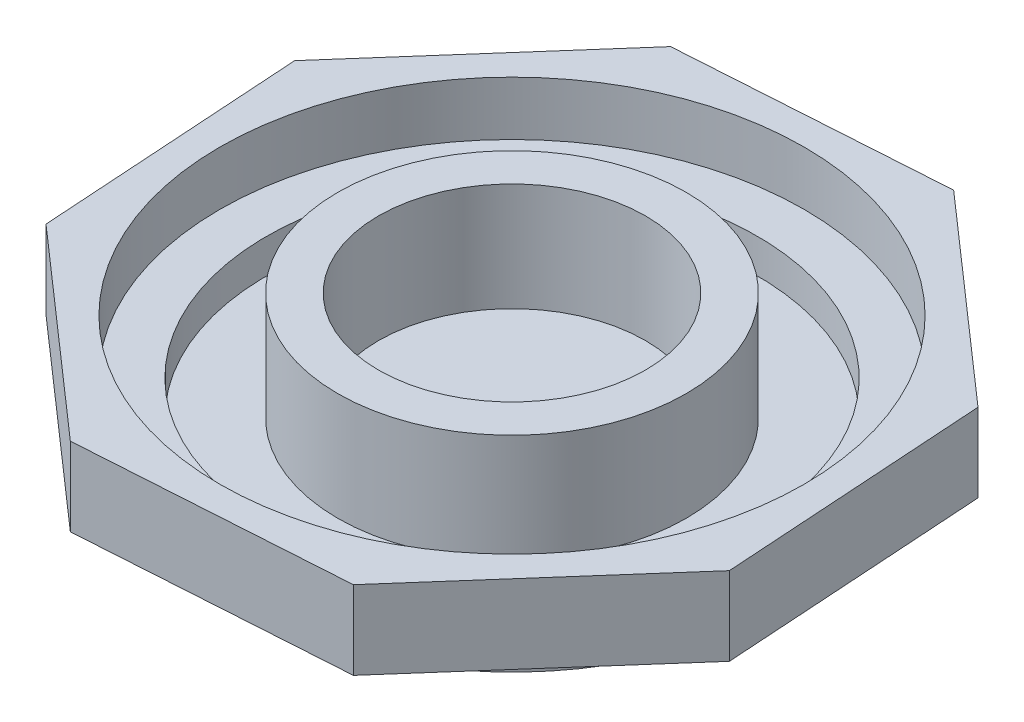
ISO-10303-21;
HEADER;
FILE_DESCRIPTION(('STEP AP214'),'2;1');
FILE_NAME('part.step','',(''),(''),'','','');
FILE_SCHEMA(('AUTOMOTIVE_DESIGN { 1 0 10303 214 1 1 1 1 }'));
ENDSEC;
DATA;
#1=APPLICATION_CONTEXT('core data for automotive mechanical design processes');
#2=APPLICATION_PROTOCOL_DEFINITION('international standard','automotive_design',2000,#1);
#3=PRODUCT_CONTEXT('',#1,'mechanical');
#4=PRODUCT('Part','Part','',(#3));
#5=PRODUCT_RELATED_PRODUCT_CATEGORY('part','',(#4));
#6=PRODUCT_DEFINITION_FORMATION('','',#4);
#7=PRODUCT_DEFINITION_CONTEXT('part definition',#1,'design');
#8=PRODUCT_DEFINITION('design','',#6,#7);
#9=PRODUCT_DEFINITION_SHAPE('','',#8);
#10=(LENGTH_UNIT() NAMED_UNIT(*) SI_UNIT(.MILLI.,.METRE.));
#11=(NAMED_UNIT(*) PLANE_ANGLE_UNIT() SI_UNIT($,.RADIAN.));
#12=(NAMED_UNIT(*) SI_UNIT($,.STERADIAN.) SOLID_ANGLE_UNIT());
#13=UNCERTAINTY_MEASURE_WITH_UNIT(LENGTH_MEASURE(1.E-05),#10,'distance_accuracy_value','');
#14=(GEOMETRIC_REPRESENTATION_CONTEXT(3) GLOBAL_UNCERTAINTY_ASSIGNED_CONTEXT((#13)) GLOBAL_UNIT_ASSIGNED_CONTEXT((#10,
#11,#12)) REPRESENTATION_CONTEXT('',''));
#15=CARTESIAN_POINT('',(0.,0.,0.));
#16=DIRECTION('',(0.,0.,1.));
#17=DIRECTION('',(1.,0.,0.));
#18=AXIS2_PLACEMENT_3D('',#15,#16,#17);
#19=CARTESIAN_POINT('',(0.,2.,0.));
#20=DIRECTION('',(0.,-1.,0.));
#21=DIRECTION('',(0.,0.,-1.));
#22=AXIS2_PLACEMENT_3D('',#19,#20,#21);
#23=CYLINDRICAL_SURFACE('',#22,13.75);
#24=CARTESIAN_POINT('',(0.,2.,0.));
#25=DIRECTION('',(0.,1.,0.));
#26=DIRECTION('',(0.,0.,1.));
#27=AXIS2_PLACEMENT_3D('',#24,#25,#26);
#28=CIRCLE('',#27,13.75);
#29=CARTESIAN_POINT('',(0.,2.,13.75));
#30=VERTEX_POINT('',#29);
#31=EDGE_CURVE('E11',#30,#30,#28,.T.);
#32=ORIENTED_EDGE('',*,*,#31,.F.);
#33=EDGE_LOOP('',(#32));
#34=FACE_BOUND('',#33,.T.);
#35=CARTESIAN_POINT('',(0.,0.,0.));
#36=DIRECTION('',(0.,1.,0.));
#37=DIRECTION('',(0.,0.,1.));
#38=AXIS2_PLACEMENT_3D('',#35,#36,#37);
#39=CIRCLE('',#38,13.75);
#40=CARTESIAN_POINT('',(0.,0.,13.75));
#41=VERTEX_POINT('',#40);
#42=EDGE_CURVE('E36',#41,#41,#39,.T.);
#43=ORIENTED_EDGE('',*,*,#42,.T.);
#44=EDGE_LOOP('',(#43));
#45=FACE_BOUND('',#44,.T.);
#46=ADVANCED_FACE('F33',(#34,#45),#23,.T.);
#47=CARTESIAN_POINT('',(0.,0.,0.));
#48=DIRECTION('',(0.,1.,0.));
#49=DIRECTION('',(0.,0.,1.));
#50=AXIS2_PLACEMENT_3D('',#47,#48,#49);
#51=PLANE('',#50);
#52=ORIENTED_EDGE('',*,*,#42,.F.);
#53=EDGE_LOOP('',(#52));
#54=FACE_BOUND('',#53,.T.);
#55=ADVANCED_FACE('F164',(#54),#51,.F.);
#56=CARTESIAN_POINT('',(7.82639063037997,6.,15.9026379165315));
#57=DIRECTION('',(-0.751308324484586,0.,-0.659951363026219));
#58=DIRECTION('',(-0.659951363026219,0.,0.751308324484586));
#59=AXIS2_PLACEMENT_3D('',#56,#57,#58);
#60=PLANE('',#59);
#61=DIRECTION('',(0.659951363026219,0.,-0.751308324484586));
#62=VECTOR('',#61,1.);
#63=CARTESIAN_POINT('',(7.82639063037997,2.,15.9026379165315));
#64=LINE('',#63,#62);
#65=CARTESIAN_POINT('',(7.82639063037997,2.,15.9026379165315));
#66=VERTEX_POINT('',#65);
#67=CARTESIAN_POINT('',(16.7789569964903,2.,5.7107692225772));
#68=VERTEX_POINT('',#67);
#69=EDGE_CURVE('E130',#66,#68,#64,.T.);
#70=ORIENTED_EDGE('',*,*,#69,.T.);
#71=DIRECTION('',(0.,-1.,0.));
#72=VECTOR('',#71,1.);
#73=CARTESIAN_POINT('',(16.7789569964903,6.,5.7107692225772));
#74=LINE('',#73,#72);
#75=CARTESIAN_POINT('',(16.7789569964903,6.,5.7107692225772));
#76=VERTEX_POINT('',#75);
#77=EDGE_CURVE('E158',#76,#68,#74,.T.);
#78=ORIENTED_EDGE('',*,*,#77,.F.);
#79=DIRECTION('',(0.659951363026219,0.,-0.751308324484586));
#80=VECTOR('',#79,1.);
#81=CARTESIAN_POINT('',(7.82639063037997,6.,15.9026379165315));
#82=LINE('',#81,#80);
#83=CARTESIAN_POINT('',(7.82639063037997,6.,15.9026379165315));
#84=VERTEX_POINT('',#83);
#85=EDGE_CURVE('E145',#84,#76,#82,.T.);
#86=ORIENTED_EDGE('',*,*,#85,.F.);
#87=DIRECTION('',(0.,-1.,0.));
#88=VECTOR('',#87,1.);
#89=CARTESIAN_POINT('',(7.82639063037997,6.,15.9026379165315));
#90=LINE('',#89,#88);
#91=EDGE_CURVE('E126',#84,#66,#90,.T.);
#92=ORIENTED_EDGE('',*,*,#91,.T.);
#93=EDGE_LOOP('',(#70,#78,#86,#92));
#94=FACE_BOUND('',#93,.T.);
#95=ADVANCED_FACE('F166',(#94),#60,.F.);
#96=CARTESIAN_POINT('',(16.7789569964903,6.,5.7107692225772));
#97=DIRECTION('',(-0.997911295054098,0.,0.0645991269558095));
#98=DIRECTION('',(0.0645991269558095,0.,0.997911295054098));
#99=AXIS2_PLACEMENT_3D('',#96,#97,#98);
#100=PLANE('',#99);
#101=DIRECTION('',(-0.0645991269558095,0.,-0.997911295054098));
#102=VECTOR('',#101,1.);
#103=CARTESIAN_POINT('',(16.7789569964903,2.,5.7107692225772));
#104=LINE('',#103,#102);
#105=CARTESIAN_POINT('',(15.9026379165315,2.,-7.82639063037997));
#106=VERTEX_POINT('',#105);
#107=EDGE_CURVE('E133',#68,#106,#104,.T.);
#108=ORIENTED_EDGE('',*,*,#107,.T.);
#109=DIRECTION('',(0.,-1.,0.));
#110=VECTOR('',#109,1.);
#111=CARTESIAN_POINT('',(15.9026379165315,6.,-7.82639063037997));
#112=LINE('',#111,#110);
#113=CARTESIAN_POINT('',(15.9026379165315,6.,-7.82639063037997));
#114=VERTEX_POINT('',#113);
#115=EDGE_CURVE('E155',#114,#106,#112,.T.);
#116=ORIENTED_EDGE('',*,*,#115,.F.);
#117=DIRECTION('',(-0.0645991269558095,0.,-0.997911295054098));
#118=VECTOR('',#117,1.);
#119=CARTESIAN_POINT('',(16.7789569964903,6.,5.7107692225772));
#120=LINE('',#119,#118);
#121=EDGE_CURVE('E93',#76,#114,#120,.T.);
#122=ORIENTED_EDGE('',*,*,#121,.F.);
#123=ORIENTED_EDGE('',*,*,#77,.T.);
#124=EDGE_LOOP('',(#108,#116,#122,#123));
#125=FACE_BOUND('',#124,.T.);
#126=ADVANCED_FACE('F171',(#125),#100,.F.);
#127=CARTESIAN_POINT('',(15.9026379165315,6.,-7.82639063037997));
#128=DIRECTION('',(-0.659951363026218,0.,0.751308324484586));
#129=DIRECTION('',(0.751308324484586,0.,0.659951363026218));
#130=AXIS2_PLACEMENT_3D('',#127,#128,#129);
#131=PLANE('',#130);
#132=DIRECTION('',(-0.751308324484586,0.,-0.659951363026218));
#133=VECTOR('',#132,1.);
#134=CARTESIAN_POINT('',(15.9026379165315,2.,-7.82639063037997));
#135=LINE('',#134,#133);
#136=CARTESIAN_POINT('',(5.71076922257719,2.,-16.7789569964903));
#137=VERTEX_POINT('',#136);
#138=EDGE_CURVE('E136',#106,#137,#135,.T.);
#139=ORIENTED_EDGE('',*,*,#138,.T.);
#140=DIRECTION('',(0.,-1.,0.));
#141=VECTOR('',#140,1.);
#142=CARTESIAN_POINT('',(5.71076922257719,6.,-16.7789569964903));
#143=LINE('',#142,#141);
#144=CARTESIAN_POINT('',(5.71076922257719,6.,-16.7789569964903));
#145=VERTEX_POINT('',#144);
#146=EDGE_CURVE('E152',#145,#137,#143,.T.);
#147=ORIENTED_EDGE('',*,*,#146,.F.);
#148=DIRECTION('',(-0.751308324484586,0.,-0.659951363026218));
#149=VECTOR('',#148,1.);
#150=CARTESIAN_POINT('',(15.9026379165315,6.,-7.82639063037997));
#151=LINE('',#150,#149);
#152=EDGE_CURVE('E264',#114,#145,#151,.T.);
#153=ORIENTED_EDGE('',*,*,#152,.F.);
#154=ORIENTED_EDGE('',*,*,#115,.T.);
#155=EDGE_LOOP('',(#139,#147,#153,#154));
#156=FACE_BOUND('',#155,.T.);
#157=ADVANCED_FACE('F178',(#156),#131,.F.);
#158=CARTESIAN_POINT('',(5.71076922257719,6.,-16.7789569964903));
#159=DIRECTION('',(0.0645991269558098,0.,0.997911295054098));
#160=DIRECTION('',(0.997911295054098,0.,-0.0645991269558098));
#161=AXIS2_PLACEMENT_3D('',#158,#159,#160);
#162=PLANE('',#161);
#163=DIRECTION('',(-0.997911295054098,0.,0.0645991269558098));
#164=VECTOR('',#163,1.);
#165=CARTESIAN_POINT('',(5.71076922257719,2.,-16.7789569964903));
#166=LINE('',#165,#164);
#167=CARTESIAN_POINT('',(-7.82639063037997,2.,-15.9026379165315));
#168=VERTEX_POINT('',#167);
#169=EDGE_CURVE('E138',#137,#168,#166,.T.);
#170=ORIENTED_EDGE('',*,*,#169,.T.);
#171=DIRECTION('',(0.,-1.,0.));
#172=VECTOR('',#171,1.);
#173=CARTESIAN_POINT('',(-7.82639063037997,6.,-15.9026379165315));
#174=LINE('',#173,#172);
#175=CARTESIAN_POINT('',(-7.82639063037997,6.,-15.9026379165315));
#176=VERTEX_POINT('',#175);
#177=EDGE_CURVE('E149',#176,#168,#174,.T.);
#178=ORIENTED_EDGE('',*,*,#177,.F.);
#179=DIRECTION('',(-0.997911295054098,0.,0.0645991269558098));
#180=VECTOR('',#179,1.);
#181=CARTESIAN_POINT('',(5.71076922257719,6.,-16.7789569964903));
#182=LINE('',#181,#180);
#183=EDGE_CURVE('E266',#145,#176,#182,.T.);
#184=ORIENTED_EDGE('',*,*,#183,.F.);
#185=ORIENTED_EDGE('',*,*,#146,.T.);
#186=EDGE_LOOP('',(#170,#178,#184,#185));
#187=FACE_BOUND('',#186,.T.);
#188=ADVANCED_FACE('F181',(#187),#162,.F.);
#189=CARTESIAN_POINT('',(-7.82639063037997,6.,-15.9026379165315));
#190=DIRECTION('',(0.751308324484586,0.,0.659951363026218));
#191=DIRECTION('',(0.659951363026218,0.,-0.751308324484586));
#192=AXIS2_PLACEMENT_3D('',#189,#190,#191);
#193=PLANE('',#192);
#194=DIRECTION('',(-0.659951363026218,0.,0.751308324484586));
#195=VECTOR('',#194,1.);
#196=CARTESIAN_POINT('',(-7.82639063037997,2.,-15.9026379165315));
#197=LINE('',#196,#195);
#198=CARTESIAN_POINT('',(-16.7789569964903,2.,-5.7107692225772));
#199=VERTEX_POINT('',#198);
#200=EDGE_CURVE('E140',#168,#199,#197,.T.);
#201=ORIENTED_EDGE('',*,*,#200,.T.);
#202=DIRECTION('',(0.,-1.,0.));
#203=VECTOR('',#202,1.);
#204=CARTESIAN_POINT('',(-16.7789569964903,6.,-5.7107692225772));
#205=LINE('',#204,#203);
#206=CARTESIAN_POINT('',(-16.7789569964903,6.,-5.7107692225772));
#207=VERTEX_POINT('',#206);
#208=EDGE_CURVE('E121',#207,#199,#205,.T.);
#209=ORIENTED_EDGE('',*,*,#208,.F.);
#210=DIRECTION('',(-0.659951363026218,0.,0.751308324484586));
#211=VECTOR('',#210,1.);
#212=CARTESIAN_POINT('',(-7.82639063037997,6.,-15.9026379165315));
#213=LINE('',#212,#211);
#214=EDGE_CURVE('E112',#176,#207,#213,.T.);
#215=ORIENTED_EDGE('',*,*,#214,.F.);
#216=ORIENTED_EDGE('',*,*,#177,.T.);
#217=EDGE_LOOP('',(#201,#209,#215,#216));
#218=FACE_BOUND('',#217,.T.);
#219=ADVANCED_FACE('F185',(#218),#193,.F.);
#220=CARTESIAN_POINT('',(-16.7789569964903,6.,-5.7107692225772));
#221=DIRECTION('',(0.997911295054098,0.,-0.0645991269558095));
#222=DIRECTION('',(-0.0645991269558095,0.,-0.997911295054098));
#223=AXIS2_PLACEMENT_3D('',#220,#221,#222);
#224=PLANE('',#223);
#225=DIRECTION('',(0.0645991269558095,0.,0.997911295054098));
#226=VECTOR('',#225,1.);
#227=CARTESIAN_POINT('',(-16.7789569964903,2.,-5.7107692225772));
#228=LINE('',#227,#226);
#229=CARTESIAN_POINT('',(-15.9026379165315,2.,7.82639063037997));
#230=VERTEX_POINT('',#229);
#231=EDGE_CURVE('E120',#199,#230,#228,.T.);
#232=ORIENTED_EDGE('',*,*,#231,.T.);
#233=DIRECTION('',(0.,-1.,0.));
#234=VECTOR('',#233,1.);
#235=CARTESIAN_POINT('',(-15.9026379165315,6.,7.82639063037997));
#236=LINE('',#235,#234);
#237=CARTESIAN_POINT('',(-15.9026379165315,6.,7.82639063037997));
#238=VERTEX_POINT('',#237);
#239=EDGE_CURVE('E117',#238,#230,#236,.T.);
#240=ORIENTED_EDGE('',*,*,#239,.F.);
#241=DIRECTION('',(0.0645991269558095,0.,0.997911295054098));
#242=VECTOR('',#241,1.);
#243=CARTESIAN_POINT('',(-16.7789569964903,6.,-5.7107692225772));
#244=LINE('',#243,#242);
#245=EDGE_CURVE('E106',#207,#238,#244,.T.);
#246=ORIENTED_EDGE('',*,*,#245,.F.);
#247=ORIENTED_EDGE('',*,*,#208,.T.);
#248=EDGE_LOOP('',(#232,#240,#246,#247));
#249=FACE_BOUND('',#248,.T.);
#250=ADVANCED_FACE('F118',(#249),#224,.F.);
#251=CARTESIAN_POINT('',(-15.9026379165315,6.,7.82639063037997));
#252=DIRECTION('',(0.659951363026219,0.,-0.751308324484586));
#253=DIRECTION('',(-0.751308324484586,0.,-0.659951363026219));
#254=AXIS2_PLACEMENT_3D('',#251,#252,#253);
#255=PLANE('',#254);
#256=DIRECTION('',(0.751308324484586,0.,0.659951363026219));
#257=VECTOR('',#256,1.);
#258=CARTESIAN_POINT('',(-15.9026379165315,2.,7.82639063037997));
#259=LINE('',#258,#257);
#260=CARTESIAN_POINT('',(-5.71076922257721,2.,16.7789569964903));
#261=VERTEX_POINT('',#260);
#262=EDGE_CURVE('E78',#230,#261,#259,.T.);
#263=ORIENTED_EDGE('',*,*,#262,.T.);
#264=DIRECTION('',(0.,-1.,0.));
#265=VECTOR('',#264,1.);
#266=CARTESIAN_POINT('',(-5.71076922257721,6.,16.7789569964903));
#267=LINE('',#266,#265);
#268=CARTESIAN_POINT('',(-5.71076922257721,6.,16.7789569964903));
#269=VERTEX_POINT('',#268);
#270=EDGE_CURVE('E122',#269,#261,#267,.T.);
#271=ORIENTED_EDGE('',*,*,#270,.F.);
#272=DIRECTION('',(0.751308324484586,0.,0.659951363026219));
#273=VECTOR('',#272,1.);
#274=CARTESIAN_POINT('',(-15.9026379165315,6.,7.82639063037997));
#275=LINE('',#274,#273);
#276=EDGE_CURVE('E110',#238,#269,#275,.T.);
#277=ORIENTED_EDGE('',*,*,#276,.F.);
#278=ORIENTED_EDGE('',*,*,#239,.T.);
#279=EDGE_LOOP('',(#263,#271,#277,#278));
#280=FACE_BOUND('',#279,.T.);
#281=ADVANCED_FACE('F124',(#280),#255,.F.);
#282=CARTESIAN_POINT('',(-5.71076922257721,6.,16.7789569964903));
#283=DIRECTION('',(-0.0645991269558097,0.,-0.997911295054098));
#284=DIRECTION('',(-0.997911295054098,0.,0.0645991269558097));
#285=AXIS2_PLACEMENT_3D('',#282,#283,#284);
#286=PLANE('',#285);
#287=DIRECTION('',(0.997911295054098,0.,-0.0645991269558097));
#288=VECTOR('',#287,1.);
#289=CARTESIAN_POINT('',(-5.71076922257721,2.,16.7789569964903));
#290=LINE('',#289,#288);
#291=EDGE_CURVE('E84',#261,#66,#290,.T.);
#292=ORIENTED_EDGE('',*,*,#291,.T.);
#293=ORIENTED_EDGE('',*,*,#91,.F.);
#294=DIRECTION('',(0.997911295054098,0.,-0.0645991269558097));
#295=VECTOR('',#294,1.);
#296=CARTESIAN_POINT('',(-5.71076922257721,6.,16.7789569964903));
#297=LINE('',#296,#295);
#298=EDGE_CURVE('E49',#269,#84,#297,.T.);
#299=ORIENTED_EDGE('',*,*,#298,.F.);
#300=ORIENTED_EDGE('',*,*,#270,.T.);
#301=EDGE_LOOP('',(#292,#293,#299,#300));
#302=FACE_BOUND('',#301,.T.);
#303=ADVANCED_FACE('F194',(#302),#286,.F.);
#304=CARTESIAN_POINT('',(0.,6.,0.));
#305=DIRECTION('',(0.,1.,0.));
#306=DIRECTION('',(0.,0.,1.));
#307=AXIS2_PLACEMENT_3D('',#304,#305,#306);
#308=PLANE('',#307);
#309=CARTESIAN_POINT('',(0.,6.,0.));
#310=DIRECTION('',(0.,1.,0.));
#311=DIRECTION('',(0.,0.,1.));
#312=AXIS2_PLACEMENT_3D('',#309,#310,#311);
#313=CIRCLE('',#312,14.875);
#314=CARTESIAN_POINT('',(0.,6.,14.875));
#315=VERTEX_POINT('',#314);
#316=EDGE_CURVE('E255',#315,#315,#313,.T.);
#317=ORIENTED_EDGE('',*,*,#316,.F.);
#318=EDGE_LOOP('',(#317));
#319=FACE_BOUND('',#318,.T.);
#320=ORIENTED_EDGE('',*,*,#85,.T.);
#321=ORIENTED_EDGE('',*,*,#121,.T.);
#322=ORIENTED_EDGE('',*,*,#152,.T.);
#323=ORIENTED_EDGE('',*,*,#183,.T.);
#324=ORIENTED_EDGE('',*,*,#214,.T.);
#325=ORIENTED_EDGE('',*,*,#245,.T.);
#326=ORIENTED_EDGE('',*,*,#276,.T.);
#327=ORIENTED_EDGE('',*,*,#298,.T.);
#328=EDGE_LOOP('',(#320,#321,#322,#323,#324,#325,#326,#327));
#329=FACE_BOUND('',#328,.T.);
#330=ADVANCED_FACE('F108',(#319,#329),#308,.T.);
#331=CARTESIAN_POINT('',(0.,2.,0.));
#332=DIRECTION('',(0.,1.,0.));
#333=DIRECTION('',(0.,0.,1.));
#334=AXIS2_PLACEMENT_3D('',#331,#332,#333);
#335=PLANE('',#334);
#336=ORIENTED_EDGE('',*,*,#31,.T.);
#337=EDGE_LOOP('',(#336));
#338=FACE_BOUND('',#337,.T.);
#339=ORIENTED_EDGE('',*,*,#69,.F.);
#340=ORIENTED_EDGE('',*,*,#291,.F.);
#341=ORIENTED_EDGE('',*,*,#262,.F.);
#342=ORIENTED_EDGE('',*,*,#231,.F.);
#343=ORIENTED_EDGE('',*,*,#200,.F.);
#344=ORIENTED_EDGE('',*,*,#169,.F.);
#345=ORIENTED_EDGE('',*,*,#138,.F.);
#346=ORIENTED_EDGE('',*,*,#107,.F.);
#347=EDGE_LOOP('',(#339,#340,#341,#342,#343,#344,#345,#346));
#348=FACE_BOUND('',#347,.T.);
#349=ADVANCED_FACE('F197',(#338,#348),#335,.F.);
#350=CARTESIAN_POINT('',(0.,3.25,0.));
#351=DIRECTION('',(0.,1.,0.));
#352=DIRECTION('',(0.,0.,1.));
#353=AXIS2_PLACEMENT_3D('',#350,#351,#352);
#354=CYLINDRICAL_SURFACE('',#353,14.875);
#355=CARTESIAN_POINT('',(0.,3.25,0.));
#356=DIRECTION('',(0.,1.,0.));
#357=DIRECTION('',(0.,0.,1.));
#358=AXIS2_PLACEMENT_3D('',#355,#356,#357);
#359=CIRCLE('',#358,14.875);
#360=CARTESIAN_POINT('',(0.,3.25,14.875));
#361=VERTEX_POINT('',#360);
#362=EDGE_CURVE('E134',#361,#361,#359,.T.);
#363=ORIENTED_EDGE('',*,*,#362,.F.);
#364=EDGE_LOOP('',(#363));
#365=FACE_BOUND('',#364,.T.);
#366=ORIENTED_EDGE('',*,*,#316,.T.);
#367=EDGE_LOOP('',(#366));
#368=FACE_BOUND('',#367,.T.);
#369=ADVANCED_FACE('F200',(#365,#368),#354,.F.);
#370=CARTESIAN_POINT('',(0.,3.25,0.));
#371=DIRECTION('',(0.,1.,0.));
#372=DIRECTION('',(0.,0.,1.));
#373=AXIS2_PLACEMENT_3D('',#370,#371,#372);
#374=PLANE('',#373);
#375=CARTESIAN_POINT('',(0.,3.25,0.));
#376=DIRECTION('',(0.,1.,0.));
#377=DIRECTION('',(0.,0.,1.));
#378=AXIS2_PLACEMENT_3D('',#375,#376,#377);
#379=CIRCLE('',#378,12.5);
#380=CARTESIAN_POINT('',(0.,3.25,12.5));
#381=VERTEX_POINT('',#380);
#382=EDGE_CURVE('E250',#381,#381,#379,.T.);
#383=ORIENTED_EDGE('',*,*,#382,.F.);
#384=EDGE_LOOP('',(#383));
#385=FACE_BOUND('',#384,.T.);
#386=ORIENTED_EDGE('',*,*,#362,.T.);
#387=EDGE_LOOP('',(#386));
#388=FACE_BOUND('',#387,.T.);
#389=ADVANCED_FACE('F207',(#385,#388),#374,.T.);
#390=CARTESIAN_POINT('',(0.,1.5,0.));
#391=DIRECTION('',(0.,1.,0.));
#392=DIRECTION('',(0.,0.,1.));
#393=AXIS2_PLACEMENT_3D('',#390,#391,#392);
#394=CYLINDRICAL_SURFACE('',#393,12.5);
#395=CARTESIAN_POINT('',(0.,1.5,0.));
#396=DIRECTION('',(0.,1.,0.));
#397=DIRECTION('',(0.,0.,1.));
#398=AXIS2_PLACEMENT_3D('',#395,#396,#397);
#399=CIRCLE('',#398,12.5);
#400=CARTESIAN_POINT('',(0.,1.5,12.5));
#401=VERTEX_POINT('',#400);
#402=EDGE_CURVE('E252',#401,#401,#399,.T.);
#403=ORIENTED_EDGE('',*,*,#402,.F.);
#404=EDGE_LOOP('',(#403));
#405=FACE_BOUND('',#404,.T.);
#406=ORIENTED_EDGE('',*,*,#382,.T.);
#407=EDGE_LOOP('',(#406));
#408=FACE_BOUND('',#407,.T.);
#409=ADVANCED_FACE('F211',(#405,#408),#394,.F.);
#410=CARTESIAN_POINT('',(0.,1.5,0.));
#411=DIRECTION('',(0.,1.,0.));
#412=DIRECTION('',(0.,0.,1.));
#413=AXIS2_PLACEMENT_3D('',#410,#411,#412);
#414=PLANE('',#413);
#415=CARTESIAN_POINT('',(0.,1.5,0.));
#416=DIRECTION('',(0.,1.,0.));
#417=DIRECTION('',(0.,0.,1.));
#418=AXIS2_PLACEMENT_3D('',#415,#416,#417);
#419=CIRCLE('',#418,8.875);
#420=CARTESIAN_POINT('',(0.,1.5,8.875));
#421=VERTEX_POINT('',#420);
#422=EDGE_CURVE('E240',#421,#421,#419,.T.);
#423=ORIENTED_EDGE('',*,*,#422,.F.);
#424=EDGE_LOOP('',(#423));
#425=FACE_BOUND('',#424,.T.);
#426=ORIENTED_EDGE('',*,*,#402,.T.);
#427=EDGE_LOOP('',(#426));
#428=FACE_BOUND('',#427,.T.);
#429=ADVANCED_FACE('F215',(#425,#428),#414,.T.);
#430=CARTESIAN_POINT('',(0.,7.,0.));
#431=DIRECTION('',(0.,-1.,0.));
#432=DIRECTION('',(0.,0.,-1.));
#433=AXIS2_PLACEMENT_3D('',#430,#431,#432);
#434=CYLINDRICAL_SURFACE('',#433,8.875);
#435=CARTESIAN_POINT('',(0.,7.,0.));
#436=DIRECTION('',(0.,1.,0.));
#437=DIRECTION('',(0.,0.,1.));
#438=AXIS2_PLACEMENT_3D('',#435,#436,#437);
#439=CIRCLE('',#438,8.875);
#440=CARTESIAN_POINT('',(0.,7.,8.875));
#441=VERTEX_POINT('',#440);
#442=EDGE_CURVE('E244',#441,#441,#439,.T.);
#443=ORIENTED_EDGE('',*,*,#442,.F.);
#444=EDGE_LOOP('',(#443));
#445=FACE_BOUND('',#444,.T.);
#446=ORIENTED_EDGE('',*,*,#422,.T.);
#447=EDGE_LOOP('',(#446));
#448=FACE_BOUND('',#447,.T.);
#449=ADVANCED_FACE('F219',(#445,#448),#434,.T.);
#450=CARTESIAN_POINT('',(0.,7.,0.));
#451=DIRECTION('',(0.,1.,0.));
#452=DIRECTION('',(0.,0.,1.));
#453=AXIS2_PLACEMENT_3D('',#450,#451,#452);
#454=PLANE('',#453);
#455=CARTESIAN_POINT('',(0.,7.,0.));
#456=DIRECTION('',(0.,1.,0.));
#457=DIRECTION('',(0.,0.,1.));
#458=AXIS2_PLACEMENT_3D('',#455,#456,#457);
#459=CIRCLE('',#458,6.8);
#460=CARTESIAN_POINT('',(0.,7.,6.8));
#461=VERTEX_POINT('',#460);
#462=EDGE_CURVE('E241',#461,#461,#459,.T.);
#463=ORIENTED_EDGE('',*,*,#462,.F.);
#464=EDGE_LOOP('',(#463));
#465=FACE_BOUND('',#464,.T.);
#466=ORIENTED_EDGE('',*,*,#442,.T.);
#467=EDGE_LOOP('',(#466));
#468=FACE_BOUND('',#467,.T.);
#469=ADVANCED_FACE('F223',(#465,#468),#454,.T.);
#470=CARTESIAN_POINT('',(0.,1.5,0.));
#471=DIRECTION('',(0.,1.,0.));
#472=DIRECTION('',(0.,0.,1.));
#473=AXIS2_PLACEMENT_3D('',#470,#471,#472);
#474=CYLINDRICAL_SURFACE('',#473,6.8);
#475=CARTESIAN_POINT('',(0.,1.5,0.));
#476=DIRECTION('',(0.,1.,0.));
#477=DIRECTION('',(0.,0.,1.));
#478=AXIS2_PLACEMENT_3D('',#475,#476,#477);
#479=CIRCLE('',#478,6.8);
#480=CARTESIAN_POINT('',(0.,1.5,6.8));
#481=VERTEX_POINT('',#480);
#482=EDGE_CURVE('E239',#481,#481,#479,.T.);
#483=ORIENTED_EDGE('',*,*,#482,.F.);
#484=EDGE_LOOP('',(#483));
#485=FACE_BOUND('',#484,.T.);
#486=ORIENTED_EDGE('',*,*,#462,.T.);
#487=EDGE_LOOP('',(#486));
#488=FACE_BOUND('',#487,.T.);
#489=ADVANCED_FACE('F227',(#485,#488),#474,.F.);
#490=CARTESIAN_POINT('',(0.,1.5,0.));
#491=DIRECTION('',(0.,1.,0.));
#492=DIRECTION('',(0.,0.,1.));
#493=AXIS2_PLACEMENT_3D('',#490,#491,#492);
#494=PLANE('',#493);
#495=ORIENTED_EDGE('',*,*,#482,.T.);
#496=EDGE_LOOP('',(#495));
#497=FACE_BOUND('',#496,.T.);
#498=ADVANCED_FACE('F231',(#497),#494,.T.);
#499=CLOSED_SHELL('',(#46,#55,#95,#126,#157,#188,#219,#250,#281,#303,#330,#349,#369,#389,#409,
#429,#449,#469,#489,#498));
#500=MANIFOLD_SOLID_BREP('B2',#499);
#501=ADVANCED_BREP_SHAPE_REPRESENTATION('',(#18,#500),#14);
#502=SHAPE_DEFINITION_REPRESENTATION(#9,#501);
ENDSEC;
END-ISO-10303-21;
